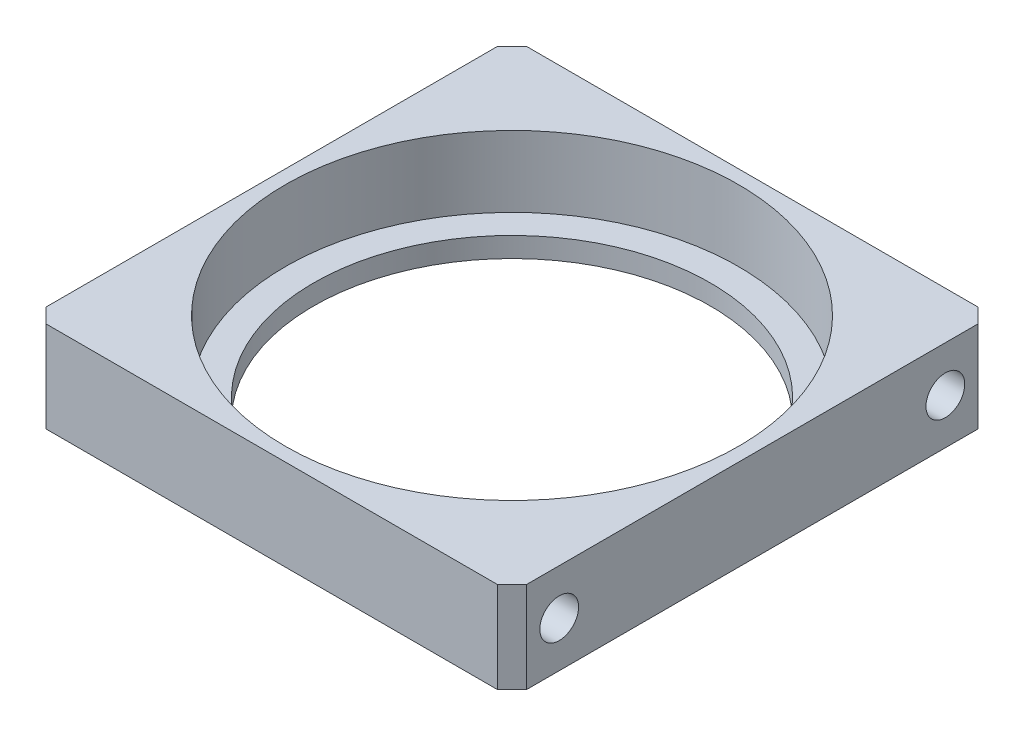
ISO-10303-21;
HEADER;
FILE_DESCRIPTION(('STEP AP214'),'2;1');
FILE_NAME('part.step','',(''),(''),'','','');
FILE_SCHEMA(('AUTOMOTIVE_DESIGN { 1 0 10303 214 1 1 1 1 }'));
ENDSEC;
DATA;
#1=APPLICATION_CONTEXT('core data for automotive mechanical design processes');
#2=APPLICATION_PROTOCOL_DEFINITION('international standard','automotive_design',2000,#1);
#3=PRODUCT_CONTEXT('',#1,'mechanical');
#4=PRODUCT('Part','Part','',(#3));
#5=PRODUCT_RELATED_PRODUCT_CATEGORY('part','',(#4));
#6=PRODUCT_DEFINITION_FORMATION('','',#4);
#7=PRODUCT_DEFINITION_CONTEXT('part definition',#1,'design');
#8=PRODUCT_DEFINITION('design','',#6,#7);
#9=PRODUCT_DEFINITION_SHAPE('','',#8);
#10=(LENGTH_UNIT() NAMED_UNIT(*) SI_UNIT(.MILLI.,.METRE.));
#11=(NAMED_UNIT(*) PLANE_ANGLE_UNIT() SI_UNIT($,.RADIAN.));
#12=(NAMED_UNIT(*) SI_UNIT($,.STERADIAN.) SOLID_ANGLE_UNIT());
#13=UNCERTAINTY_MEASURE_WITH_UNIT(LENGTH_MEASURE(1.E-05),#10,'distance_accuracy_value','');
#14=(GEOMETRIC_REPRESENTATION_CONTEXT(3) GLOBAL_UNCERTAINTY_ASSIGNED_CONTEXT((#13)) GLOBAL_UNIT_ASSIGNED_CONTEXT((#10,
#11,#12)) REPRESENTATION_CONTEXT('',''));
#15=CARTESIAN_POINT('',(0.,0.,0.));
#16=DIRECTION('',(0.,0.,1.));
#17=DIRECTION('',(1.,0.,0.));
#18=AXIS2_PLACEMENT_3D('',#15,#16,#17);
#19=CARTESIAN_POINT('',(-11.6840000000025,3.175,-13.4703841816037));
#20=DIRECTION('',(-1.,0.,0.));
#21=DIRECTION('',(0.,0.,1.));
#22=AXIS2_PLACEMENT_3D('',#19,#20,#21);
#23=CONICAL_SURFACE('',#22,1.35255000012257,1.02974425869626);
#24=CARTESIAN_POINT('',(-10.8713059697152,3.175,-13.4703841816037));
#25=VERTEX_POINT('',#24);
#26=VERTEX_LOOP('',#25);
#27=FACE_BOUND('',#26,.T.);
#28=CARTESIAN_POINT('',(-11.684,3.175,-13.4703841816037));
#29=DIRECTION('',(-1.,0.,0.));
#30=DIRECTION('',(0.,0.,1.));
#31=AXIS2_PLACEMENT_3D('',#28,#29,#30);
#32=CIRCLE('',#31,1.35254999999999);
#33=CARTESIAN_POINT('',(-11.684,3.175,-12.1178341816037));
#34=VERTEX_POINT('',#33);
#35=EDGE_CURVE('E98',#34,#34,#32,.T.);
#36=ORIENTED_EDGE('',*,*,#35,.T.);
#37=EDGE_LOOP('',(#36));
#38=FACE_BOUND('',#37,.T.);
#39=ADVANCED_FACE('F19',(#27,#38),#23,.F.);
#40=CARTESIAN_POINT('',(-11.6840000000025,3.17500000000001,13.4703841816037));
#41=DIRECTION('',(-1.,0.,0.));
#42=DIRECTION('',(0.,0.,1.));
#43=AXIS2_PLACEMENT_3D('',#40,#41,#42);
#44=CONICAL_SURFACE('',#43,1.35255000000534,1.02974425867032);
#45=CARTESIAN_POINT('',(-10.871305969772,3.17500000000001,13.4703841816037));
#46=VERTEX_POINT('',#45);
#47=VERTEX_LOOP('',#46);
#48=FACE_BOUND('',#47,.T.);
#49=CARTESIAN_POINT('',(-11.684,3.17500000000001,13.4703841816037));
#50=DIRECTION('',(-1.,0.,0.));
#51=DIRECTION('',(0.,0.,1.));
#52=AXIS2_PLACEMENT_3D('',#49,#50,#51);
#53=CIRCLE('',#52,1.35254999999999);
#54=CARTESIAN_POINT('',(-11.684,3.17500000000001,14.8229341816037));
#55=VERTEX_POINT('',#54);
#56=EDGE_CURVE('E100',#55,#55,#53,.T.);
#57=ORIENTED_EDGE('',*,*,#56,.T.);
#58=EDGE_LOOP('',(#57));
#59=FACE_BOUND('',#58,.T.);
#60=ADVANCED_FACE('F95',(#48,#59),#44,.F.);
#61=CARTESIAN_POINT('',(11.6839999999456,3.175,-13.4703841816037));
#62=DIRECTION('',(1.,0.,0.));
#63=DIRECTION('',(0.,0.,-1.));
#64=AXIS2_PLACEMENT_3D('',#61,#62,#63);
#65=CONICAL_SURFACE('',#64,1.35255000000534,1.02974425869497);
#66=CARTESIAN_POINT('',(10.8713059698005,3.175,-13.4703841816606));
#67=VERTEX_POINT('',#66);
#68=VERTEX_LOOP('',#67);
#69=FACE_BOUND('',#68,.T.);
#70=CARTESIAN_POINT('',(11.684,3.175,-13.4703841816037));
#71=DIRECTION('',(1.,0.,0.));
#72=DIRECTION('',(0.,0.,-1.));
#73=AXIS2_PLACEMENT_3D('',#70,#71,#72);
#74=CIRCLE('',#73,1.35254999999999);
#75=CARTESIAN_POINT('',(11.684,3.175,-14.8229341816037));
#76=VERTEX_POINT('',#75);
#77=EDGE_CURVE('E152',#76,#76,#74,.T.);
#78=ORIENTED_EDGE('',*,*,#77,.T.);
#79=EDGE_LOOP('',(#78));
#80=FACE_BOUND('',#79,.T.);
#81=ADVANCED_FACE('F157',(#69,#80),#65,.F.);
#82=CARTESIAN_POINT('',(11.6840000000593,3.17500000000001,13.4703841816037));
#83=DIRECTION('',(1.,0.,0.));
#84=DIRECTION('',(0.,0.,-1.));
#85=AXIS2_PLACEMENT_3D('',#82,#83,#84);
#86=CONICAL_SURFACE('',#85,1.35255000006573,1.02974425864683);
#87=CARTESIAN_POINT('',(10.8713059697152,3.17500000000001,13.4703841816037));
#88=VERTEX_POINT('',#87);
#89=VERTEX_LOOP('',#88);
#90=FACE_BOUND('',#89,.T.);
#91=CARTESIAN_POINT('',(11.684,3.17500000000001,13.4703841816037));
#92=DIRECTION('',(1.,0.,0.));
#93=DIRECTION('',(0.,0.,-1.));
#94=AXIS2_PLACEMENT_3D('',#91,#92,#93);
#95=CIRCLE('',#94,1.35254999999999);
#96=CARTESIAN_POINT('',(11.684,3.17500000000001,12.1178341816037));
#97=VERTEX_POINT('',#96);
#98=EDGE_CURVE('E150',#97,#97,#95,.T.);
#99=ORIENTED_EDGE('',*,*,#98,.T.);
#100=EDGE_LOOP('',(#99));
#101=FACE_BOUND('',#100,.T.);
#102=ADVANCED_FACE('F241',(#90,#101),#86,.F.);
#103=CARTESIAN_POINT('',(0.,1.397,0.));
#104=DIRECTION('',(0.,1.,0.));
#105=DIRECTION('',(0.,0.,1.));
#106=AXIS2_PLACEMENT_3D('',#103,#104,#105);
#107=CYLINDRICAL_SURFACE('',#106,15.8115);
#108=CARTESIAN_POINT('',(0.,6.35,0.));
#109=DIRECTION('',(0.,1.,0.));
#110=DIRECTION('',(0.,0.,1.));
#111=AXIS2_PLACEMENT_3D('',#108,#109,#110);
#112=CIRCLE('',#111,15.8115);
#113=CARTESIAN_POINT('',(0.,6.35,15.8115));
#114=VERTEX_POINT('',#113);
#115=EDGE_CURVE('E22',#114,#114,#112,.T.);
#116=ORIENTED_EDGE('',*,*,#115,.T.);
#117=EDGE_LOOP('',(#116));
#118=FACE_BOUND('',#117,.T.);
#119=CARTESIAN_POINT('',(0.,1.397,0.));
#120=DIRECTION('',(0.,1.,0.));
#121=DIRECTION('',(0.,0.,1.));
#122=AXIS2_PLACEMENT_3D('',#119,#120,#121);
#123=CIRCLE('',#122,15.8115);
#124=CARTESIAN_POINT('',(0.,1.397,15.8115));
#125=VERTEX_POINT('',#124);
#126=EDGE_CURVE('E126',#125,#125,#123,.T.);
#127=ORIENTED_EDGE('',*,*,#126,.F.);
#128=EDGE_LOOP('',(#127));
#129=FACE_BOUND('',#128,.T.);
#130=ADVANCED_FACE('F238',(#118,#129),#107,.F.);
#131=CARTESIAN_POINT('',(-16.764,3.175,-13.4703841816037));
#132=DIRECTION('',(-1.,0.,0.));
#133=DIRECTION('',(0.,0.,1.));
#134=AXIS2_PLACEMENT_3D('',#131,#132,#133);
#135=CYLINDRICAL_SURFACE('',#134,1.35254999999999);
#136=ORIENTED_EDGE('',*,*,#35,.F.);
#137=EDGE_LOOP('',(#136));
#138=FACE_BOUND('',#137,.T.);
#139=CARTESIAN_POINT('',(-16.764,3.175,-13.4703841816037));
#140=DIRECTION('',(-1.,0.,0.));
#141=DIRECTION('',(0.,0.,1.));
#142=AXIS2_PLACEMENT_3D('',#139,#140,#141);
#143=CIRCLE('',#142,1.35254999999999);
#144=CARTESIAN_POINT('',(-16.764,3.175,-12.1178341816037));
#145=VERTEX_POINT('',#144);
#146=EDGE_CURVE('E124',#145,#145,#143,.T.);
#147=ORIENTED_EDGE('',*,*,#146,.T.);
#148=EDGE_LOOP('',(#147));
#149=FACE_BOUND('',#148,.T.);
#150=ADVANCED_FACE('F234',(#138,#149),#135,.F.);
#151=CARTESIAN_POINT('',(-16.764,3.17500000000001,13.4703841816037));
#152=DIRECTION('',(-1.,0.,0.));
#153=DIRECTION('',(0.,0.,1.));
#154=AXIS2_PLACEMENT_3D('',#151,#152,#153);
#155=CYLINDRICAL_SURFACE('',#154,1.35254999999999);
#156=ORIENTED_EDGE('',*,*,#56,.F.);
#157=EDGE_LOOP('',(#156));
#158=FACE_BOUND('',#157,.T.);
#159=CARTESIAN_POINT('',(-16.764,3.17500000000001,13.4703841816037));
#160=DIRECTION('',(-1.,0.,0.));
#161=DIRECTION('',(0.,0.,1.));
#162=AXIS2_PLACEMENT_3D('',#159,#160,#161);
#163=CIRCLE('',#162,1.35254999999999);
#164=CARTESIAN_POINT('',(-16.764,3.17500000000001,14.8229341816037));
#165=VERTEX_POINT('',#164);
#166=EDGE_CURVE('E120',#165,#165,#163,.T.);
#167=ORIENTED_EDGE('',*,*,#166,.T.);
#168=EDGE_LOOP('',(#167));
#169=FACE_BOUND('',#168,.T.);
#170=ADVANCED_FACE('F230',(#158,#169),#155,.F.);
#171=CARTESIAN_POINT('',(-15.7479738224622,0.,-16.764));
#172=DIRECTION('',(0.707106781186549,0.,0.707106781186546));
#173=DIRECTION('',(0.707106781186546,0.,-0.707106781186549));
#174=AXIS2_PLACEMENT_3D('',#171,#172,#173);
#175=PLANE('',#174);
#176=DIRECTION('',(0.,1.,0.));
#177=VECTOR('',#176,1.);
#178=CARTESIAN_POINT('',(-15.7479738224622,6.35,-16.764));
#179=LINE('',#178,#177);
#180=CARTESIAN_POINT('',(-15.7479738224622,6.35,-16.764));
#181=VERTEX_POINT('',#180);
#182=CARTESIAN_POINT('',(-15.7479738224622,0.,-16.764));
#183=VERTEX_POINT('',#182);
#184=EDGE_CURVE('E392',#181,#183,#179,.F.);
#185=ORIENTED_EDGE('',*,*,#184,.T.);
#186=DIRECTION('',(0.707106781186546,0.,-0.707106781186549));
#187=VECTOR('',#186,1.);
#188=CARTESIAN_POINT('',(-15.7479738224622,0.,-16.764));
#189=LINE('',#188,#187);
#190=CARTESIAN_POINT('',(-16.764,0.,-15.7479738224622));
#191=VERTEX_POINT('',#190);
#192=EDGE_CURVE('E103',#191,#183,#189,.T.);
#193=ORIENTED_EDGE('',*,*,#192,.F.);
#194=DIRECTION('',(0.,1.,0.));
#195=VECTOR('',#194,1.);
#196=CARTESIAN_POINT('',(-16.764,6.35,-15.7479738224622));
#197=LINE('',#196,#195);
#198=CARTESIAN_POINT('',(-16.764,6.35,-15.7479738224622));
#199=VERTEX_POINT('',#198);
#200=EDGE_CURVE('E123',#191,#199,#197,.T.);
#201=ORIENTED_EDGE('',*,*,#200,.T.);
#202=DIRECTION('',(0.707106781186546,0.,-0.707106781186549));
#203=VECTOR('',#202,1.);
#204=CARTESIAN_POINT('',(-16.764,6.35,-15.7479738224622));
#205=LINE('',#204,#203);
#206=EDGE_CURVE('E143',#199,#181,#205,.T.);
#207=ORIENTED_EDGE('',*,*,#206,.T.);
#208=EDGE_LOOP('',(#185,#193,#201,#207));
#209=FACE_BOUND('',#208,.T.);
#210=ADVANCED_FACE('F163',(#209),#175,.F.);
#211=CARTESIAN_POINT('',(16.764,3.175,-13.4703841816037));
#212=DIRECTION('',(1.,0.,0.));
#213=DIRECTION('',(0.,0.,-1.));
#214=AXIS2_PLACEMENT_3D('',#211,#212,#213);
#215=CYLINDRICAL_SURFACE('',#214,1.35254999999999);
#216=ORIENTED_EDGE('',*,*,#77,.F.);
#217=EDGE_LOOP('',(#216));
#218=FACE_BOUND('',#217,.T.);
#219=CARTESIAN_POINT('',(16.764,3.175,-13.4703841816037));
#220=DIRECTION('',(1.,0.,0.));
#221=DIRECTION('',(0.,0.,-1.));
#222=AXIS2_PLACEMENT_3D('',#219,#220,#221);
#223=CIRCLE('',#222,1.35254999999999);
#224=CARTESIAN_POINT('',(16.764,3.175,-14.8229341816037));
#225=VERTEX_POINT('',#224);
#226=EDGE_CURVE('E116',#225,#225,#223,.T.);
#227=ORIENTED_EDGE('',*,*,#226,.T.);
#228=EDGE_LOOP('',(#227));
#229=FACE_BOUND('',#228,.T.);
#230=ADVANCED_FACE('F159',(#218,#229),#215,.F.);
#231=CARTESIAN_POINT('',(16.764,3.17500000000001,13.4703841816037));
#232=DIRECTION('',(1.,0.,0.));
#233=DIRECTION('',(0.,0.,-1.));
#234=AXIS2_PLACEMENT_3D('',#231,#232,#233);
#235=CYLINDRICAL_SURFACE('',#234,1.35254999999999);
#236=ORIENTED_EDGE('',*,*,#98,.F.);
#237=EDGE_LOOP('',(#236));
#238=FACE_BOUND('',#237,.T.);
#239=CARTESIAN_POINT('',(16.764,3.17500000000001,13.4703841816037));
#240=DIRECTION('',(1.,0.,0.));
#241=DIRECTION('',(0.,0.,-1.));
#242=AXIS2_PLACEMENT_3D('',#239,#240,#241);
#243=CIRCLE('',#242,1.35254999999999);
#244=CARTESIAN_POINT('',(16.764,3.17500000000001,12.1178341816037));
#245=VERTEX_POINT('',#244);
#246=EDGE_CURVE('E112',#245,#245,#243,.T.);
#247=ORIENTED_EDGE('',*,*,#246,.T.);
#248=EDGE_LOOP('',(#247));
#249=FACE_BOUND('',#248,.T.);
#250=ADVANCED_FACE('F162',(#238,#249),#235,.F.);
#251=CARTESIAN_POINT('',(16.7640000000001,0.,-15.7479738224622));
#252=DIRECTION('',(-0.70710678118655,0.,0.707106781186545));
#253=DIRECTION('',(0.707106781186545,0.,0.70710678118655));
#254=AXIS2_PLACEMENT_3D('',#251,#252,#253);
#255=PLANE('',#254);
#256=DIRECTION('',(0.,1.,0.));
#257=VECTOR('',#256,1.);
#258=CARTESIAN_POINT('',(16.764,6.35,-15.7479738224622));
#259=LINE('',#258,#257);
#260=CARTESIAN_POINT('',(16.764,6.35,-15.7479738224622));
#261=VERTEX_POINT('',#260);
#262=CARTESIAN_POINT('',(16.764,0.,-15.7479738224622));
#263=VERTEX_POINT('',#262);
#264=EDGE_CURVE('E115',#261,#263,#259,.F.);
#265=ORIENTED_EDGE('',*,*,#264,.T.);
#266=DIRECTION('',(0.707106781186545,0.,0.70710678118655));
#267=VECTOR('',#266,1.);
#268=CARTESIAN_POINT('',(16.7640000000001,0.,-15.7479738224622));
#269=LINE('',#268,#267);
#270=CARTESIAN_POINT('',(15.7479738224623,0.,-16.764));
#271=VERTEX_POINT('',#270);
#272=EDGE_CURVE('E148',#271,#263,#269,.T.);
#273=ORIENTED_EDGE('',*,*,#272,.F.);
#274=DIRECTION('',(0.,1.,0.));
#275=VECTOR('',#274,1.);
#276=CARTESIAN_POINT('',(15.7479738224623,6.35,-16.764));
#277=LINE('',#276,#275);
#278=CARTESIAN_POINT('',(15.7479738224623,6.35,-16.764));
#279=VERTEX_POINT('',#278);
#280=EDGE_CURVE('E398',#271,#279,#277,.T.);
#281=ORIENTED_EDGE('',*,*,#280,.T.);
#282=DIRECTION('',(0.707106781186545,0.,0.70710678118655));
#283=VECTOR('',#282,1.);
#284=CARTESIAN_POINT('',(15.7479738224623,6.35,-16.764));
#285=LINE('',#284,#283);
#286=EDGE_CURVE('E137',#279,#261,#285,.T.);
#287=ORIENTED_EDGE('',*,*,#286,.T.);
#288=EDGE_LOOP('',(#265,#273,#281,#287));
#289=FACE_BOUND('',#288,.T.);
#290=ADVANCED_FACE('F220',(#289),#255,.F.);
#291=CARTESIAN_POINT('',(15.7479738224621,0.,16.7640000000001));
#292=DIRECTION('',(-0.707106781186543,0.,-0.707106781186552));
#293=DIRECTION('',(-0.707106781186552,0.,0.707106781186543));
#294=AXIS2_PLACEMENT_3D('',#291,#292,#293);
#295=PLANE('',#294);
#296=DIRECTION('',(0.,1.,0.));
#297=VECTOR('',#296,1.);
#298=CARTESIAN_POINT('',(15.7479738224621,6.35,16.764));
#299=LINE('',#298,#297);
#300=CARTESIAN_POINT('',(15.7479738224621,6.35,16.7640000000001));
#301=VERTEX_POINT('',#300);
#302=CARTESIAN_POINT('',(15.7479738224621,0.,16.764));
#303=VERTEX_POINT('',#302);
#304=EDGE_CURVE('E415',#301,#303,#299,.F.);
#305=ORIENTED_EDGE('',*,*,#304,.T.);
#306=DIRECTION('',(-0.707106781186552,0.,0.707106781186543));
#307=VECTOR('',#306,1.);
#308=CARTESIAN_POINT('',(15.7479738224621,0.,16.7640000000001));
#309=LINE('',#308,#307);
#310=CARTESIAN_POINT('',(16.7639999999999,0.,15.7479738224623));
#311=VERTEX_POINT('',#310);
#312=EDGE_CURVE('E37',#311,#303,#309,.T.);
#313=ORIENTED_EDGE('',*,*,#312,.F.);
#314=DIRECTION('',(0.,1.,0.));
#315=VECTOR('',#314,1.);
#316=CARTESIAN_POINT('',(16.764,6.35,15.7479738224624));
#317=LINE('',#316,#315);
#318=CARTESIAN_POINT('',(16.764,6.35,15.7479738224623));
#319=VERTEX_POINT('',#318);
#320=EDGE_CURVE('E420',#311,#319,#317,.T.);
#321=ORIENTED_EDGE('',*,*,#320,.T.);
#322=DIRECTION('',(-0.707106781186552,0.,0.707106781186543));
#323=VECTOR('',#322,1.);
#324=CARTESIAN_POINT('',(16.7639999999999,6.35,15.7479738224624));
#325=LINE('',#324,#323);
#326=EDGE_CURVE('E131',#319,#301,#325,.T.);
#327=ORIENTED_EDGE('',*,*,#326,.T.);
#328=EDGE_LOOP('',(#305,#313,#321,#327));
#329=FACE_BOUND('',#328,.T.);
#330=ADVANCED_FACE('F217',(#329),#295,.F.);
#331=CARTESIAN_POINT('',(-16.7640000000002,0.,15.7479738224621));
#332=DIRECTION('',(0.707106781186555,0.,-0.70710678118654));
#333=DIRECTION('',(-0.70710678118654,0.,-0.707106781186555));
#334=AXIS2_PLACEMENT_3D('',#331,#332,#333);
#335=PLANE('',#334);
#336=DIRECTION('',(0.,1.,0.));
#337=VECTOR('',#336,1.);
#338=CARTESIAN_POINT('',(-16.764,6.35,15.7479738224621));
#339=LINE('',#338,#337);
#340=CARTESIAN_POINT('',(-16.7640000000001,6.35,15.7479738224621));
#341=VERTEX_POINT('',#340);
#342=CARTESIAN_POINT('',(-16.764,0.,15.7479738224621));
#343=VERTEX_POINT('',#342);
#344=EDGE_CURVE('E399',#341,#343,#339,.F.);
#345=ORIENTED_EDGE('',*,*,#344,.T.);
#346=DIRECTION('',(-0.70710678118654,0.,-0.707106781186555));
#347=VECTOR('',#346,1.);
#348=CARTESIAN_POINT('',(-16.7640000000002,0.,15.7479738224621));
#349=LINE('',#348,#347);
#350=CARTESIAN_POINT('',(-15.7479738224624,0.,16.7639999999999));
#351=VERTEX_POINT('',#350);
#352=EDGE_CURVE('E145',#351,#343,#349,.T.);
#353=ORIENTED_EDGE('',*,*,#352,.F.);
#354=DIRECTION('',(0.,1.,0.));
#355=VECTOR('',#354,1.);
#356=CARTESIAN_POINT('',(-15.7479738224624,6.35,16.764));
#357=LINE('',#356,#355);
#358=CARTESIAN_POINT('',(-15.7479738224624,6.35,16.7639999999999));
#359=VERTEX_POINT('',#358);
#360=EDGE_CURVE('E413',#351,#359,#357,.T.);
#361=ORIENTED_EDGE('',*,*,#360,.T.);
#362=DIRECTION('',(-0.70710678118654,0.,-0.707106781186555));
#363=VECTOR('',#362,1.);
#364=CARTESIAN_POINT('',(-15.7479738224624,6.35,16.7639999999998));
#365=LINE('',#364,#363);
#366=EDGE_CURVE('E128',#359,#341,#365,.T.);
#367=ORIENTED_EDGE('',*,*,#366,.T.);
#368=EDGE_LOOP('',(#345,#353,#361,#367));
#369=FACE_BOUND('',#368,.T.);
#370=ADVANCED_FACE('F211',(#369),#335,.F.);
#371=CARTESIAN_POINT('',(0.,6.35,0.));
#372=DIRECTION('',(0.,-1.,0.));
#373=DIRECTION('',(0.,0.,-1.));
#374=AXIS2_PLACEMENT_3D('',#371,#372,#373);
#375=PLANE('',#374);
#376=ORIENTED_EDGE('',*,*,#366,.F.);
#377=DIRECTION('',(-1.,0.,0.));
#378=VECTOR('',#377,1.);
#379=CARTESIAN_POINT('',(-16.764,6.35,16.764));
#380=LINE('',#379,#378);
#381=EDGE_CURVE('E111',#359,#301,#380,.F.);
#382=ORIENTED_EDGE('',*,*,#381,.T.);
#383=ORIENTED_EDGE('',*,*,#326,.F.);
#384=DIRECTION('',(0.,0.,1.));
#385=VECTOR('',#384,1.);
#386=CARTESIAN_POINT('',(16.764,6.35,16.764));
#387=LINE('',#386,#385);
#388=EDGE_CURVE('E417',#319,#261,#387,.F.);
#389=ORIENTED_EDGE('',*,*,#388,.T.);
#390=ORIENTED_EDGE('',*,*,#286,.F.);
#391=DIRECTION('',(1.,0.,0.));
#392=VECTOR('',#391,1.);
#393=CARTESIAN_POINT('',(-16.764,6.35,-16.764));
#394=LINE('',#393,#392);
#395=EDGE_CURVE('E119',#279,#181,#394,.F.);
#396=ORIENTED_EDGE('',*,*,#395,.T.);
#397=ORIENTED_EDGE('',*,*,#206,.F.);
#398=DIRECTION('',(0.,0.,-1.));
#399=VECTOR('',#398,1.);
#400=CARTESIAN_POINT('',(-16.764,6.35,16.764));
#401=LINE('',#400,#399);
#402=EDGE_CURVE('E426',#199,#341,#401,.F.);
#403=ORIENTED_EDGE('',*,*,#402,.T.);
#404=EDGE_LOOP('',(#376,#382,#383,#389,#390,#396,#397,#403));
#405=FACE_BOUND('',#404,.T.);
#406=ORIENTED_EDGE('',*,*,#115,.F.);
#407=EDGE_LOOP('',(#406));
#408=FACE_BOUND('',#407,.T.);
#409=ADVANCED_FACE('F203',(#405,#408),#375,.F.);
#410=CARTESIAN_POINT('',(0.,1.397,0.));
#411=DIRECTION('',(0.,1.,0.));
#412=DIRECTION('',(0.,0.,1.));
#413=AXIS2_PLACEMENT_3D('',#410,#411,#412);
#414=PLANE('',#413);
#415=ORIENTED_EDGE('',*,*,#126,.T.);
#416=EDGE_LOOP('',(#415));
#417=FACE_BOUND('',#416,.T.);
#418=CARTESIAN_POINT('',(0.,1.397,0.));
#419=DIRECTION('',(0.,1.,0.));
#420=DIRECTION('',(0.,0.,1.));
#421=AXIS2_PLACEMENT_3D('',#418,#419,#420);
#422=CIRCLE('',#421,13.843);
#423=CARTESIAN_POINT('',(0.,1.397,13.843));
#424=VERTEX_POINT('',#423);
#425=EDGE_CURVE('E107',#424,#424,#422,.F.);
#426=ORIENTED_EDGE('',*,*,#425,.T.);
#427=EDGE_LOOP('',(#426));
#428=FACE_BOUND('',#427,.T.);
#429=ADVANCED_FACE('F201',(#417,#428),#414,.T.);
#430=CARTESIAN_POINT('',(-16.764,6.35,16.764));
#431=DIRECTION('',(1.,0.,0.));
#432=DIRECTION('',(0.,0.,-1.));
#433=AXIS2_PLACEMENT_3D('',#430,#431,#432);
#434=PLANE('',#433);
#435=ORIENTED_EDGE('',*,*,#344,.F.);
#436=ORIENTED_EDGE('',*,*,#402,.F.);
#437=ORIENTED_EDGE('',*,*,#200,.F.);
#438=DIRECTION('',(0.,0.,-1.));
#439=VECTOR('',#438,1.);
#440=CARTESIAN_POINT('',(-16.764,0.,0.));
#441=LINE('',#440,#439);
#442=EDGE_CURVE('E110',#343,#191,#441,.T.);
#443=ORIENTED_EDGE('',*,*,#442,.F.);
#444=EDGE_LOOP('',(#435,#436,#437,#443));
#445=FACE_BOUND('',#444,.T.);
#446=ORIENTED_EDGE('',*,*,#166,.F.);
#447=EDGE_LOOP('',(#446));
#448=FACE_BOUND('',#447,.T.);
#449=ORIENTED_EDGE('',*,*,#146,.F.);
#450=EDGE_LOOP('',(#449));
#451=FACE_BOUND('',#450,.T.);
#452=ADVANCED_FACE('F181',(#445,#448,#451),#434,.F.);
#453=CARTESIAN_POINT('',(-16.764,6.35,-16.764));
#454=DIRECTION('',(0.,0.,1.));
#455=DIRECTION('',(1.,0.,0.));
#456=AXIS2_PLACEMENT_3D('',#453,#454,#455);
#457=PLANE('',#456);
#458=ORIENTED_EDGE('',*,*,#280,.F.);
#459=DIRECTION('',(1.,0.,0.));
#460=VECTOR('',#459,1.);
#461=CARTESIAN_POINT('',(0.,0.,-16.764));
#462=LINE('',#461,#460);
#463=EDGE_CURVE('E403',#183,#271,#462,.T.);
#464=ORIENTED_EDGE('',*,*,#463,.F.);
#465=ORIENTED_EDGE('',*,*,#184,.F.);
#466=ORIENTED_EDGE('',*,*,#395,.F.);
#467=EDGE_LOOP('',(#458,#464,#465,#466));
#468=FACE_BOUND('',#467,.T.);
#469=ADVANCED_FACE('F170',(#468),#457,.F.);
#470=CARTESIAN_POINT('',(16.764,6.35,16.764));
#471=DIRECTION('',(-1.,0.,0.));
#472=DIRECTION('',(0.,0.,1.));
#473=AXIS2_PLACEMENT_3D('',#470,#471,#472);
#474=PLANE('',#473);
#475=ORIENTED_EDGE('',*,*,#320,.F.);
#476=DIRECTION('',(0.,0.,-1.));
#477=VECTOR('',#476,1.);
#478=CARTESIAN_POINT('',(16.764,0.,0.));
#479=LINE('',#478,#477);
#480=EDGE_CURVE('E404',#263,#311,#479,.F.);
#481=ORIENTED_EDGE('',*,*,#480,.F.);
#482=ORIENTED_EDGE('',*,*,#264,.F.);
#483=ORIENTED_EDGE('',*,*,#388,.F.);
#484=EDGE_LOOP('',(#475,#481,#482,#483));
#485=FACE_BOUND('',#484,.T.);
#486=ORIENTED_EDGE('',*,*,#246,.F.);
#487=EDGE_LOOP('',(#486));
#488=FACE_BOUND('',#487,.T.);
#489=ORIENTED_EDGE('',*,*,#226,.F.);
#490=EDGE_LOOP('',(#489));
#491=FACE_BOUND('',#490,.T.);
#492=ADVANCED_FACE('F167',(#485,#488,#491),#474,.F.);
#493=CARTESIAN_POINT('',(-16.764,6.35,16.764));
#494=DIRECTION('',(0.,0.,-1.));
#495=DIRECTION('',(-1.,0.,0.));
#496=AXIS2_PLACEMENT_3D('',#493,#494,#495);
#497=PLANE('',#496);
#498=ORIENTED_EDGE('',*,*,#360,.F.);
#499=DIRECTION('',(1.,0.,0.));
#500=VECTOR('',#499,1.);
#501=CARTESIAN_POINT('',(0.,0.,16.764));
#502=LINE('',#501,#500);
#503=EDGE_CURVE('E28',#303,#351,#502,.F.);
#504=ORIENTED_EDGE('',*,*,#503,.F.);
#505=ORIENTED_EDGE('',*,*,#304,.F.);
#506=ORIENTED_EDGE('',*,*,#381,.F.);
#507=EDGE_LOOP('',(#498,#504,#505,#506));
#508=FACE_BOUND('',#507,.T.);
#509=ADVANCED_FACE('F169',(#508),#497,.F.);
#510=CARTESIAN_POINT('',(0.,0.,0.));
#511=DIRECTION('',(0.,1.,0.));
#512=DIRECTION('',(0.,0.,1.));
#513=AXIS2_PLACEMENT_3D('',#510,#511,#512);
#514=CYLINDRICAL_SURFACE('',#513,13.843);
#515=ORIENTED_EDGE('',*,*,#425,.F.);
#516=EDGE_LOOP('',(#515));
#517=FACE_BOUND('',#516,.T.);
#518=CARTESIAN_POINT('',(0.,0.,0.));
#519=DIRECTION('',(0.,1.,0.));
#520=DIRECTION('',(0.,0.,1.));
#521=AXIS2_PLACEMENT_3D('',#518,#519,#520);
#522=CIRCLE('',#521,13.843);
#523=CARTESIAN_POINT('',(0.,0.,13.843));
#524=VERTEX_POINT('',#523);
#525=EDGE_CURVE('E11',#524,#524,#522,.T.);
#526=ORIENTED_EDGE('',*,*,#525,.F.);
#527=EDGE_LOOP('',(#526));
#528=FACE_BOUND('',#527,.T.);
#529=ADVANCED_FACE('F178',(#517,#528),#514,.F.);
#530=CARTESIAN_POINT('',(0.,0.,0.));
#531=DIRECTION('',(0.,-1.,0.));
#532=DIRECTION('',(0.,0.,-1.));
#533=AXIS2_PLACEMENT_3D('',#530,#531,#532);
#534=PLANE('',#533);
#535=ORIENTED_EDGE('',*,*,#525,.T.);
#536=EDGE_LOOP('',(#535));
#537=FACE_BOUND('',#536,.T.);
#538=ORIENTED_EDGE('',*,*,#312,.T.);
#539=ORIENTED_EDGE('',*,*,#503,.T.);
#540=ORIENTED_EDGE('',*,*,#352,.T.);
#541=ORIENTED_EDGE('',*,*,#442,.T.);
#542=ORIENTED_EDGE('',*,*,#192,.T.);
#543=ORIENTED_EDGE('',*,*,#463,.T.);
#544=ORIENTED_EDGE('',*,*,#272,.T.);
#545=ORIENTED_EDGE('',*,*,#480,.T.);
#546=EDGE_LOOP('',(#538,#539,#540,#541,#542,#543,#544,#545));
#547=FACE_BOUND('',#546,.T.);
#548=ADVANCED_FACE('F186',(#537,#547),#534,.T.);
#549=CLOSED_SHELL('',(#39,#60,#81,#102,#130,#150,#170,#210,#230,#250,#290,#330,#370,#409,#429,
#452,#469,#492,#509,#529,#548));
#550=MANIFOLD_SOLID_BREP('B1',#549);
#551=ADVANCED_BREP_SHAPE_REPRESENTATION('',(#18,#550),#14);
#552=SHAPE_DEFINITION_REPRESENTATION(#9,#551);
ENDSEC;
END-ISO-10303-21;
